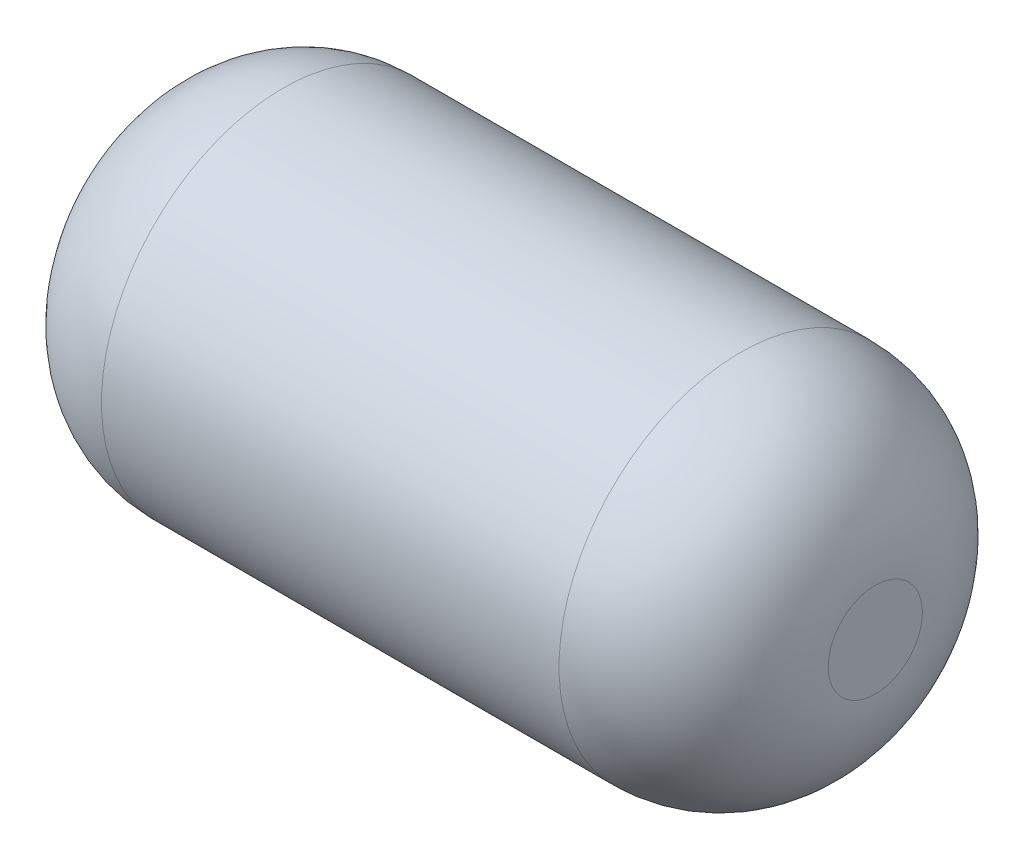
ISO-10303-21;
HEADER;
FILE_DESCRIPTION(('STEP AP214'),'2;1');
FILE_NAME('part.step','',(''),(''),'','','');
FILE_SCHEMA(('AUTOMOTIVE_DESIGN { 1 0 10303 214 1 1 1 1 }'));
ENDSEC;
DATA;
#1=APPLICATION_CONTEXT('core data for automotive mechanical design processes');
#2=APPLICATION_PROTOCOL_DEFINITION('international standard','automotive_design',2000,#1);
#3=PRODUCT_CONTEXT('',#1,'mechanical');
#4=PRODUCT('Part','Part','',(#3));
#5=PRODUCT_RELATED_PRODUCT_CATEGORY('part','',(#4));
#6=PRODUCT_DEFINITION_FORMATION('','',#4);
#7=PRODUCT_DEFINITION_CONTEXT('part definition',#1,'design');
#8=PRODUCT_DEFINITION('design','',#6,#7);
#9=PRODUCT_DEFINITION_SHAPE('','',#8);
#10=(LENGTH_UNIT() NAMED_UNIT(*) SI_UNIT(.MILLI.,.METRE.));
#11=(NAMED_UNIT(*) PLANE_ANGLE_UNIT() SI_UNIT($,.RADIAN.));
#12=(NAMED_UNIT(*) SI_UNIT($,.STERADIAN.) SOLID_ANGLE_UNIT());
#13=UNCERTAINTY_MEASURE_WITH_UNIT(LENGTH_MEASURE(1.E-05),#10,'distance_accuracy_value','');
#14=(GEOMETRIC_REPRESENTATION_CONTEXT(3) GLOBAL_UNCERTAINTY_ASSIGNED_CONTEXT((#13)) GLOBAL_UNIT_ASSIGNED_CONTEXT((#10,
#11,#12)) REPRESENTATION_CONTEXT('',''));
#15=CARTESIAN_POINT('',(0.,0.,0.));
#16=DIRECTION('',(0.,0.,1.));
#17=DIRECTION('',(1.,0.,0.));
#18=AXIS2_PLACEMENT_3D('',#15,#16,#17);
#19=CARTESIAN_POINT('',(135.,0.,0.));
#20=DIRECTION('',(-1.,0.,0.));
#21=DIRECTION('',(0.,0.,1.));
#22=AXIS2_PLACEMENT_3D('',#19,#20,#21);
#23=CYLINDRICAL_SURFACE('',#22,67.5);
#24=CARTESIAN_POINT('',(85.,0.,0.));
#25=DIRECTION('',(1.,0.,0.));
#26=DIRECTION('',(0.,0.,-1.));
#27=AXIS2_PLACEMENT_3D('',#24,#25,#26);
#28=CIRCLE('',#27,67.5);
#29=CARTESIAN_POINT('',(85.,0.,-67.5));
#30=VERTEX_POINT('',#29);
#31=EDGE_CURVE('E51',#30,#30,#28,.F.);
#32=ORIENTED_EDGE('',*,*,#31,.T.);
#33=EDGE_LOOP('',(#32));
#34=FACE_BOUND('',#33,.T.);
#35=CARTESIAN_POINT('',(-85.,0.,0.));
#36=DIRECTION('',(1.,0.,0.));
#37=DIRECTION('',(0.,0.,-1.));
#38=AXIS2_PLACEMENT_3D('',#35,#36,#37);
#39=CIRCLE('',#38,67.5);
#40=CARTESIAN_POINT('',(-85.,0.,-67.5));
#41=VERTEX_POINT('',#40);
#42=EDGE_CURVE('E56',#41,#41,#39,.T.);
#43=ORIENTED_EDGE('',*,*,#42,.T.);
#44=EDGE_LOOP('',(#43));
#45=FACE_BOUND('',#44,.T.);
#46=ADVANCED_FACE('F43',(#34,#45),#23,.T.);
#47=CARTESIAN_POINT('',(135.,0.,0.));
#48=DIRECTION('',(1.,0.,0.));
#49=DIRECTION('',(0.,0.,-1.));
#50=AXIS2_PLACEMENT_3D('',#47,#48,#49);
#51=PLANE('',#50);
#52=CARTESIAN_POINT('',(135.,0.,0.));
#53=DIRECTION('',(1.,0.,0.));
#54=DIRECTION('',(0.,0.,-1.));
#55=AXIS2_PLACEMENT_3D('',#52,#53,#54);
#56=CIRCLE('',#55,17.5);
#57=CARTESIAN_POINT('',(135.,0.,-17.5));
#58=VERTEX_POINT('',#57);
#59=EDGE_CURVE('E61',#58,#58,#56,.T.);
#60=ORIENTED_EDGE('',*,*,#59,.T.);
#61=EDGE_LOOP('',(#60));
#62=FACE_BOUND('',#61,.T.);
#63=ADVANCED_FACE('F68',(#62),#51,.T.);
#64=CARTESIAN_POINT('',(-135.,0.,0.));
#65=DIRECTION('',(1.,0.,0.));
#66=DIRECTION('',(0.,0.,-1.));
#67=AXIS2_PLACEMENT_3D('',#64,#65,#66);
#68=PLANE('',#67);
#69=CARTESIAN_POINT('',(-135.,0.,0.));
#70=DIRECTION('',(1.,0.,0.));
#71=DIRECTION('',(0.,0.,-1.));
#72=AXIS2_PLACEMENT_3D('',#69,#70,#71);
#73=CIRCLE('',#72,17.5);
#74=CARTESIAN_POINT('',(-135.,0.,-17.5));
#75=VERTEX_POINT('',#74);
#76=EDGE_CURVE('E10',#75,#75,#73,.F.);
#77=ORIENTED_EDGE('',*,*,#76,.T.);
#78=EDGE_LOOP('',(#77));
#79=FACE_BOUND('',#78,.T.);
#80=ADVANCED_FACE('F72',(#79),#68,.F.);
#81=CARTESIAN_POINT('',(85.,0.,0.));
#82=DIRECTION('',(1.,0.,0.));
#83=DIRECTION('',(0.,0.,-1.));
#84=AXIS2_PLACEMENT_3D('',#81,#82,#83);
#85=DEGENERATE_TOROIDAL_SURFACE('',#84,17.5,50.,.T.);
#86=ORIENTED_EDGE('',*,*,#31,.F.);
#87=EDGE_LOOP('',(#86));
#88=FACE_BOUND('',#87,.T.);
#89=ORIENTED_EDGE('',*,*,#59,.F.);
#90=EDGE_LOOP('',(#89));
#91=FACE_BOUND('',#90,.T.);
#92=ADVANCED_FACE('F70',(#88,#91),#85,.T.);
#93=CARTESIAN_POINT('',(-85.,0.,0.));
#94=DIRECTION('',(1.,0.,0.));
#95=DIRECTION('',(0.,0.,-1.));
#96=AXIS2_PLACEMENT_3D('',#93,#94,#95);
#97=DEGENERATE_TOROIDAL_SURFACE('',#96,17.5,50.,.T.);
#98=ORIENTED_EDGE('',*,*,#76,.F.);
#99=EDGE_LOOP('',(#98));
#100=FACE_BOUND('',#99,.T.);
#101=ORIENTED_EDGE('',*,*,#42,.F.);
#102=EDGE_LOOP('',(#101));
#103=FACE_BOUND('',#102,.T.);
#104=ADVANCED_FACE('F45',(#100,#103),#97,.T.);
#105=CLOSED_SHELL('',(#46,#63,#80,#92,#104));
#106=MANIFOLD_SOLID_BREP('B2',#105);
#107=ADVANCED_BREP_SHAPE_REPRESENTATION('',(#18,#106),#14);
#108=SHAPE_DEFINITION_REPRESENTATION(#9,#107);
ENDSEC;
END-ISO-10303-21;
